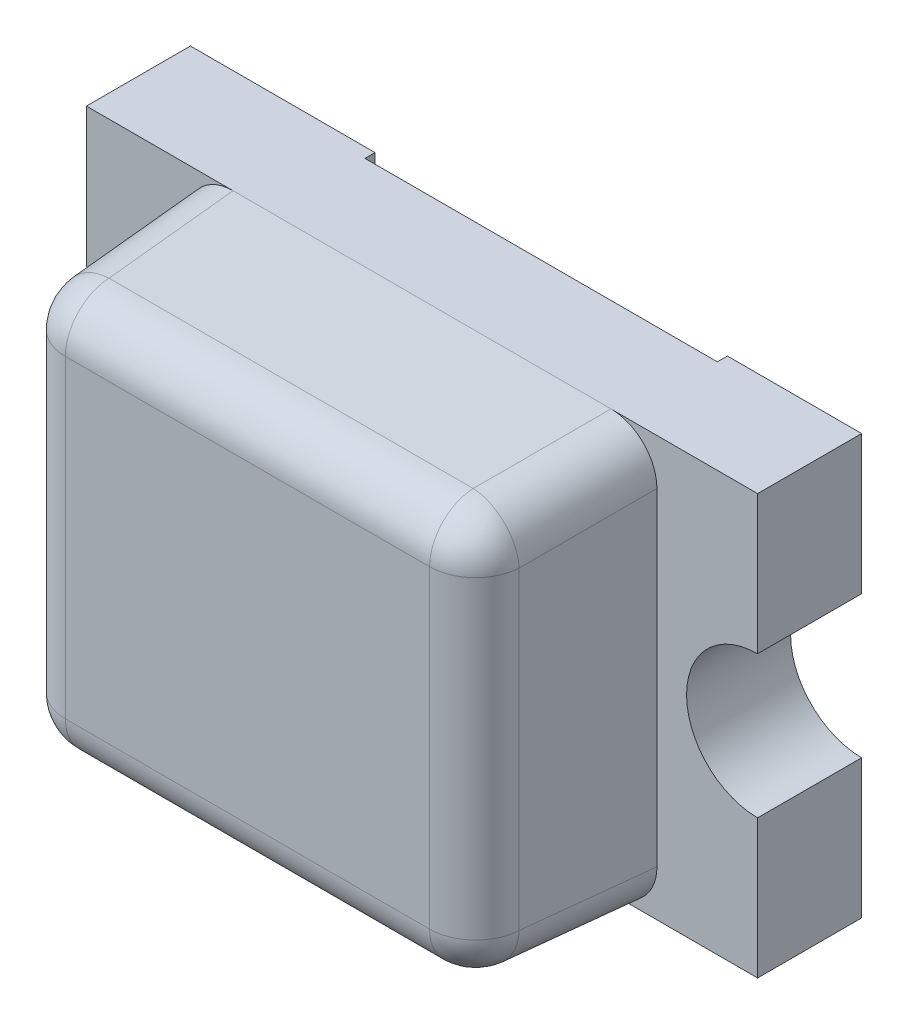
ISO-10303-21;
HEADER;
FILE_DESCRIPTION(('STEP AP214'),'2;1');
FILE_NAME('part.step','',(''),(''),'','','');
FILE_SCHEMA(('AUTOMOTIVE_DESIGN { 1 0 10303 214 1 1 1 1 }'));
ENDSEC;
DATA;
#1=APPLICATION_CONTEXT('core data for automotive mechanical design processes');
#2=APPLICATION_PROTOCOL_DEFINITION('international standard','automotive_design',2000,#1);
#3=PRODUCT_CONTEXT('',#1,'mechanical');
#4=PRODUCT('Part','Part','',(#3));
#5=PRODUCT_RELATED_PRODUCT_CATEGORY('part','',(#4));
#6=PRODUCT_DEFINITION_FORMATION('','',#4);
#7=PRODUCT_DEFINITION_CONTEXT('part definition',#1,'design');
#8=PRODUCT_DEFINITION('design','',#6,#7);
#9=PRODUCT_DEFINITION_SHAPE('','',#8);
#10=(LENGTH_UNIT() NAMED_UNIT(*) SI_UNIT(.MILLI.,.METRE.));
#11=(NAMED_UNIT(*) PLANE_ANGLE_UNIT() SI_UNIT($,.RADIAN.));
#12=(NAMED_UNIT(*) SI_UNIT($,.STERADIAN.) SOLID_ANGLE_UNIT());
#13=UNCERTAINTY_MEASURE_WITH_UNIT(LENGTH_MEASURE(1.E-05),#10,'distance_accuracy_value','');
#14=(GEOMETRIC_REPRESENTATION_CONTEXT(3) GLOBAL_UNCERTAINTY_ASSIGNED_CONTEXT((#13)) GLOBAL_UNIT_ASSIGNED_CONTEXT((#10,
#11,#12)) REPRESENTATION_CONTEXT('',''));
#15=CARTESIAN_POINT('',(0.,0.,0.));
#16=DIRECTION('',(0.,0.,1.));
#17=DIRECTION('',(1.,0.,0.));
#18=AXIS2_PLACEMENT_3D('',#15,#16,#17);
#19=CARTESIAN_POINT('',(0.163168531233106,-0.486831468766896,0.325652261310296));
#20=DIRECTION('',(-0.0522644276887139,-0.0522644276887139,-0.997264688634237));
#21=DIRECTION('',(0.,0.998629534754574,-0.0523359562429438));
#22=AXIS2_PLACEMENT_3D('',#19,#20,#21);
#23=CYLINDRICAL_SURFACE('',#22,0.13716);
#24=CARTESIAN_POINT('',(0.182412025197795,-0.467587974802207,0.69284));
#25=DIRECTION('',(0.052264427688714,0.052264427688714,0.997264688634237));
#26=DIRECTION('',(0.,-0.998629534754574,0.0523359562429439));
#27=AXIS2_PLACEMENT_3D('',#24,#25,#26);
#28=CIRCLE('',#27,0.13716);
#29=CARTESIAN_POINT('',(0.0454399982108576,-0.467587974802207,0.700018399758282));
#30=VERTEX_POINT('',#29);
#31=CARTESIAN_POINT('',(0.182412025197795,-0.604560001789144,0.700018399758282));
#32=VERTEX_POINT('',#31);
#33=EDGE_CURVE('E426',#30,#32,#28,.T.);
#34=ORIENTED_EDGE('',*,*,#33,.F.);
#35=DIRECTION('',(0.0522644276887139,0.0522644276887139,0.997264688634237));
#36=VECTOR('',#35,1.);
#37=CARTESIAN_POINT('',(0.02633308276625,-0.486694890246814,0.335436734478859));
#38=LINE('',#37,#36);
#39=CARTESIAN_POINT('',(0.0250000000000006,-0.488027973013064,0.31));
#40=VERTEX_POINT('',#39);
#41=EDGE_CURVE('E43',#40,#30,#38,.T.);
#42=ORIENTED_EDGE('',*,*,#41,.F.);
#43=CARTESIAN_POINT('',(0.162348230977076,-0.487651769022926,0.31));
#44=DIRECTION('',(0.,0.,1.));
#45=DIRECTION('',(-0.707106781186547,-0.707106781186548,0.));
#46=AXIS2_PLACEMENT_3D('',#43,#44,#45);
#47=ELLIPSE('',#46,0.137536204342943,0.13716);
#48=CARTESIAN_POINT('',(0.161972026986938,-0.625,0.31));
#49=VERTEX_POINT('',#48);
#50=EDGE_CURVE('E11',#40,#49,#47,.T.);
#51=ORIENTED_EDGE('',*,*,#50,.T.);
#52=DIRECTION('',(0.0522644276887139,0.0522644276887139,0.997264688634237));
#53=VECTOR('',#52,1.);
#54=CARTESIAN_POINT('',(0.163168531233106,-0.623803495753833,0.332830661068578));
#55=LINE('',#54,#53);
#56=EDGE_CURVE('E29',#49,#32,#55,.T.);
#57=ORIENTED_EDGE('',*,*,#56,.T.);
#58=EDGE_LOOP('',(#34,#42,#51,#57));
#59=FACE_BOUND('',#58,.T.);
#60=ADVANCED_FACE('F18',(#59),#23,.T.);
#61=CARTESIAN_POINT('',(0.182412025197795,-0.467587974802207,0.69284));
#62=DIRECTION('',(0.,0.,1.));
#63=DIRECTION('',(1.,0.,0.));
#64=AXIS2_PLACEMENT_3D('',#61,#62,#63);
#65=SPHERICAL_SURFACE('',#64,0.13716);
#66=CARTESIAN_POINT('',(0.182412025197795,-0.467587974802207,0.69284));
#67=DIRECTION('',(-1.,0.,0.));
#68=DIRECTION('',(0.,0.,1.));
#69=AXIS2_PLACEMENT_3D('',#66,#67,#68);
#70=CIRCLE('',#69,0.13716);
#71=CARTESIAN_POINT('',(0.182412025197795,-0.467587974802207,0.83));
#72=VERTEX_POINT('',#71);
#73=EDGE_CURVE('E310',#32,#72,#70,.T.);
#74=ORIENTED_EDGE('',*,*,#73,.T.);
#75=CARTESIAN_POINT('',(0.182412025197795,-0.467587974802207,0.69284));
#76=DIRECTION('',(0.,-1.,0.));
#77=DIRECTION('',(0.,0.,-1.));
#78=AXIS2_PLACEMENT_3D('',#75,#76,#77);
#79=CIRCLE('',#78,0.13716);
#80=EDGE_CURVE('E314',#72,#30,#79,.T.);
#81=ORIENTED_EDGE('',*,*,#80,.T.);
#82=ORIENTED_EDGE('',*,*,#33,.T.);
#83=EDGE_LOOP('',(#74,#81,#82));
#84=FACE_BOUND('',#83,.T.);
#85=ADVANCED_FACE('F540',(#84),#65,.T.);
#86=CARTESIAN_POINT('',(0.,-0.467587974802207,0.69284));
#87=DIRECTION('',(1.,0.,0.));
#88=DIRECTION('',(0.,1.,0.));
#89=AXIS2_PLACEMENT_3D('',#86,#87,#88);
#90=CYLINDRICAL_SURFACE('',#89,0.13716);
#91=CARTESIAN_POINT('',(1.26758797480221,-0.467587974802207,0.69284));
#92=DIRECTION('',(1.,0.,0.));
#93=DIRECTION('',(0.,0.,-1.));
#94=AXIS2_PLACEMENT_3D('',#91,#92,#93);
#95=CIRCLE('',#94,0.13716);
#96=CARTESIAN_POINT('',(1.26758797480221,-0.467587974802207,0.83));
#97=VERTEX_POINT('',#96);
#98=CARTESIAN_POINT('',(1.26758797480221,-0.604560001789144,0.700018399758282));
#99=VERTEX_POINT('',#98);
#100=EDGE_CURVE('E328',#97,#99,#95,.T.);
#101=ORIENTED_EDGE('',*,*,#100,.F.);
#102=DIRECTION('',(-1.,0.,0.));
#103=VECTOR('',#102,1.);
#104=CARTESIAN_POINT('',(1.39774795477282,-0.467587974802207,0.83));
#105=LINE('',#104,#103);
#106=EDGE_CURVE('E429',#97,#72,#105,.T.);
#107=ORIENTED_EDGE('',*,*,#106,.T.);
#108=ORIENTED_EDGE('',*,*,#73,.F.);
#109=DIRECTION('',(1.,0.,0.));
#110=VECTOR('',#109,1.);
#111=CARTESIAN_POINT('',(0.0522520452271821,-0.604560001789144,0.700018399758282));
#112=LINE('',#111,#110);
#113=EDGE_CURVE('E455',#32,#99,#112,.T.);
#114=ORIENTED_EDGE('',*,*,#113,.T.);
#115=EDGE_LOOP('',(#101,#107,#108,#114));
#116=FACE_BOUND('',#115,.T.);
#117=ADVANCED_FACE('F666',(#116),#90,.T.);
#118=CARTESIAN_POINT('',(0.182412025197795,0.,0.69284));
#119=DIRECTION('',(0.,-1.,0.));
#120=DIRECTION('',(1.,0.,0.));
#121=AXIS2_PLACEMENT_3D('',#118,#119,#120);
#122=CYLINDRICAL_SURFACE('',#121,0.13716);
#123=CARTESIAN_POINT('',(0.182412025197795,0.467587974802206,0.69284));
#124=DIRECTION('',(0.,1.,0.));
#125=DIRECTION('',(0.,0.,1.));
#126=AXIS2_PLACEMENT_3D('',#123,#124,#125);
#127=CIRCLE('',#126,0.13716);
#128=CARTESIAN_POINT('',(0.0454399982108576,0.467587974802206,0.700018399758282));
#129=VERTEX_POINT('',#128);
#130=CARTESIAN_POINT('',(0.182412025197795,0.467587974802206,0.83));
#131=VERTEX_POINT('',#130);
#132=EDGE_CURVE('E294',#129,#131,#127,.T.);
#133=ORIENTED_EDGE('',*,*,#132,.F.);
#134=DIRECTION('',(0.,-1.,0.));
#135=VECTOR('',#134,1.);
#136=CARTESIAN_POINT('',(0.0454399982108575,0.597747954772819,0.700018399758282));
#137=LINE('',#136,#135);
#138=EDGE_CURVE('E391',#129,#30,#137,.T.);
#139=ORIENTED_EDGE('',*,*,#138,.T.);
#140=ORIENTED_EDGE('',*,*,#80,.F.);
#141=DIRECTION('',(0.,1.,0.));
#142=VECTOR('',#141,1.);
#143=CARTESIAN_POINT('',(0.182412025197795,-0.597747954772819,0.83));
#144=LINE('',#143,#142);
#145=EDGE_CURVE('E387',#72,#131,#144,.T.);
#146=ORIENTED_EDGE('',*,*,#145,.T.);
#147=EDGE_LOOP('',(#133,#139,#140,#146));
#148=FACE_BOUND('',#147,.T.);
#149=ADVANCED_FACE('F544',(#148),#122,.T.);
#150=CARTESIAN_POINT('',(1.26758797480221,-0.467587974802207,0.69284));
#151=DIRECTION('',(0.,0.,1.));
#152=DIRECTION('',(1.,0.,0.));
#153=AXIS2_PLACEMENT_3D('',#150,#151,#152);
#154=SPHERICAL_SURFACE('',#153,0.13716);
#155=CARTESIAN_POINT('',(1.26758797480221,-0.467587974802206,0.69284));
#156=DIRECTION('',(-0.052264427688714,0.052264427688714,0.997264688634237));
#157=DIRECTION('',(0.,-0.998629534754574,0.0523359562429439));
#158=AXIS2_PLACEMENT_3D('',#155,#156,#157);
#159=CIRCLE('',#158,0.13716);
#160=CARTESIAN_POINT('',(1.40456000178914,-0.467587974802207,0.700018399758282));
#161=VERTEX_POINT('',#160);
#162=EDGE_CURVE('E338',#99,#161,#159,.T.);
#163=ORIENTED_EDGE('',*,*,#162,.T.);
#164=CARTESIAN_POINT('',(1.26758797480221,-0.467587974802207,0.69284));
#165=DIRECTION('',(0.,-1.,0.));
#166=DIRECTION('',(0.,0.,-1.));
#167=AXIS2_PLACEMENT_3D('',#164,#165,#166);
#168=CIRCLE('',#167,0.13716);
#169=EDGE_CURVE('E334',#161,#97,#168,.T.);
#170=ORIENTED_EDGE('',*,*,#169,.T.);
#171=ORIENTED_EDGE('',*,*,#100,.T.);
#172=EDGE_LOOP('',(#163,#170,#171));
#173=FACE_BOUND('',#172,.T.);
#174=ADVANCED_FACE('F702',(#173),#154,.T.);
#175=CARTESIAN_POINT('',(0.182412025197795,0.467587974802206,0.69284));
#176=DIRECTION('',(0.,0.,1.));
#177=DIRECTION('',(1.,0.,0.));
#178=AXIS2_PLACEMENT_3D('',#175,#176,#177);
#179=SPHERICAL_SURFACE('',#178,0.13716);
#180=CARTESIAN_POINT('',(0.182412025197795,0.467587974802206,0.69284));
#181=DIRECTION('',(-1.,0.,0.));
#182=DIRECTION('',(0.,-1.,0.));
#183=AXIS2_PLACEMENT_3D('',#180,#181,#182);
#184=CIRCLE('',#183,0.13716);
#185=CARTESIAN_POINT('',(0.182412025197795,0.604560001789144,0.700018399758282));
#186=VERTEX_POINT('',#185);
#187=EDGE_CURVE('E305',#131,#186,#184,.T.);
#188=ORIENTED_EDGE('',*,*,#187,.T.);
#189=CARTESIAN_POINT('',(0.182412025197795,0.467587974802206,0.69284));
#190=DIRECTION('',(0.052264427688714,-0.052264427688714,0.997264688634237));
#191=DIRECTION('',(0.998629534754574,0.,-0.0523359562429439));
#192=AXIS2_PLACEMENT_3D('',#189,#190,#191);
#193=CIRCLE('',#192,0.13716);
#194=EDGE_CURVE('E296',#186,#129,#193,.T.);
#195=ORIENTED_EDGE('',*,*,#194,.T.);
#196=ORIENTED_EDGE('',*,*,#132,.T.);
#197=EDGE_LOOP('',(#188,#195,#196));
#198=FACE_BOUND('',#197,.T.);
#199=ADVANCED_FACE('F699',(#198),#179,.T.);
#200=CARTESIAN_POINT('',(1.28669489024681,-0.486694890246814,0.328258334720577));
#201=DIRECTION('',(0.0522644276887139,-0.0522644276887139,-0.997264688634237));
#202=DIRECTION('',(-0.998629534754574,0.,-0.0523359562429438));
#203=AXIS2_PLACEMENT_3D('',#200,#201,#202);
#204=CYLINDRICAL_SURFACE('',#203,0.13716);
#205=CARTESIAN_POINT('',(1.28765176902293,-0.487651769022926,0.31));
#206=DIRECTION('',(0.,0.,1.));
#207=DIRECTION('',(0.707106781186548,-0.707106781186547,0.));
#208=AXIS2_PLACEMENT_3D('',#205,#206,#207);
#209=ELLIPSE('',#208,0.137536204342943,0.13716);
#210=CARTESIAN_POINT('',(1.28802797301306,-0.625,0.31));
#211=VERTEX_POINT('',#210);
#212=CARTESIAN_POINT('',(1.425,-0.488027973013063,0.31));
#213=VERTEX_POINT('',#212);
#214=EDGE_CURVE('E297',#211,#213,#209,.T.);
#215=ORIENTED_EDGE('',*,*,#214,.T.);
#216=DIRECTION('',(-0.0522644276887139,0.0522644276887139,0.997264688634237));
#217=VECTOR('',#216,1.);
#218=CARTESIAN_POINT('',(1.42366691723375,-0.486694890246814,0.335436734478859));
#219=LINE('',#218,#217);
#220=EDGE_CURVE('E83',#213,#161,#219,.T.);
#221=ORIENTED_EDGE('',*,*,#220,.T.);
#222=ORIENTED_EDGE('',*,*,#162,.F.);
#223=DIRECTION('',(-0.0522644276887139,0.0522644276887139,0.997264688634237));
#224=VECTOR('',#223,1.);
#225=CARTESIAN_POINT('',(1.28614857616649,-0.623120603153426,0.345861028119986));
#226=LINE('',#225,#224);
#227=EDGE_CURVE('E438',#211,#99,#226,.T.);
#228=ORIENTED_EDGE('',*,*,#227,.F.);
#229=EDGE_LOOP('',(#215,#221,#222,#228));
#230=FACE_BOUND('',#229,.T.);
#231=ADVANCED_FACE('F695',(#230),#204,.T.);
#232=CARTESIAN_POINT('',(1.26758797480221,0.,0.69284));
#233=DIRECTION('',(0.,1.,0.));
#234=DIRECTION('',(-1.,0.,0.));
#235=AXIS2_PLACEMENT_3D('',#232,#233,#234);
#236=CYLINDRICAL_SURFACE('',#235,0.13716);
#237=CARTESIAN_POINT('',(1.26758797480221,0.467587974802206,0.69284));
#238=DIRECTION('',(0.,1.,0.));
#239=DIRECTION('',(0.,0.,1.));
#240=AXIS2_PLACEMENT_3D('',#237,#238,#239);
#241=CIRCLE('',#240,0.13716);
#242=CARTESIAN_POINT('',(1.26758797480221,0.467587974802206,0.83));
#243=VERTEX_POINT('',#242);
#244=CARTESIAN_POINT('',(1.40456000178914,0.467587974802206,0.700018399758282));
#245=VERTEX_POINT('',#244);
#246=EDGE_CURVE('E400',#243,#245,#241,.T.);
#247=ORIENTED_EDGE('',*,*,#246,.F.);
#248=DIRECTION('',(0.,-1.,0.));
#249=VECTOR('',#248,1.);
#250=CARTESIAN_POINT('',(1.26758797480221,0.597747954772819,0.83));
#251=LINE('',#250,#249);
#252=EDGE_CURVE('E333',#243,#97,#251,.T.);
#253=ORIENTED_EDGE('',*,*,#252,.T.);
#254=ORIENTED_EDGE('',*,*,#169,.F.);
#255=DIRECTION('',(0.,1.,0.));
#256=VECTOR('',#255,1.);
#257=CARTESIAN_POINT('',(1.40456000178914,-0.597747954772819,0.700018399758282));
#258=LINE('',#257,#256);
#259=EDGE_CURVE('E329',#161,#245,#258,.T.);
#260=ORIENTED_EDGE('',*,*,#259,.T.);
#261=EDGE_LOOP('',(#247,#253,#254,#260));
#262=FACE_BOUND('',#261,.T.);
#263=ADVANCED_FACE('F692',(#262),#236,.T.);
#264=CARTESIAN_POINT('',(0.,0.467587974802206,0.69284));
#265=DIRECTION('',(-1.,0.,0.));
#266=DIRECTION('',(0.,0.,1.));
#267=AXIS2_PLACEMENT_3D('',#264,#265,#266);
#268=CYLINDRICAL_SURFACE('',#267,0.13716);
#269=CARTESIAN_POINT('',(1.26758797480221,0.467587974802206,0.69284));
#270=DIRECTION('',(1.,0.,0.));
#271=DIRECTION('',(0.,0.,-1.));
#272=AXIS2_PLACEMENT_3D('',#269,#270,#271);
#273=CIRCLE('',#272,0.13716);
#274=CARTESIAN_POINT('',(1.26758797480221,0.604560001789144,0.700018399758282));
#275=VERTEX_POINT('',#274);
#276=EDGE_CURVE('E292',#275,#243,#273,.T.);
#277=ORIENTED_EDGE('',*,*,#276,.F.);
#278=DIRECTION('',(-1.,0.,0.));
#279=VECTOR('',#278,1.);
#280=CARTESIAN_POINT('',(1.39774795477282,0.604560001789144,0.700018399758282));
#281=LINE('',#280,#279);
#282=EDGE_CURVE('E100',#275,#186,#281,.T.);
#283=ORIENTED_EDGE('',*,*,#282,.T.);
#284=ORIENTED_EDGE('',*,*,#187,.F.);
#285=DIRECTION('',(1.,0.,0.));
#286=VECTOR('',#285,1.);
#287=CARTESIAN_POINT('',(0.052252045227182,0.467587974802206,0.83));
#288=LINE('',#287,#286);
#289=EDGE_CURVE('E454',#131,#243,#288,.T.);
#290=ORIENTED_EDGE('',*,*,#289,.T.);
#291=EDGE_LOOP('',(#277,#283,#284,#290));
#292=FACE_BOUND('',#291,.T.);
#293=ADVANCED_FACE('F687',(#292),#268,.T.);
#294=CARTESIAN_POINT('',(0.163305109753187,0.486694890246814,0.328258334720577));
#295=DIRECTION('',(-0.0522644276887139,0.0522644276887139,-0.997264688634237));
#296=DIRECTION('',(-0.998629534754574,0.,0.0523359562429438));
#297=AXIS2_PLACEMENT_3D('',#294,#295,#296);
#298=CYLINDRICAL_SURFACE('',#297,0.13716);
#299=CARTESIAN_POINT('',(0.162348230977075,0.487651769022926,0.31));
#300=DIRECTION('',(0.,0.,1.));
#301=DIRECTION('',(-0.707106781186548,0.707106781186548,0.));
#302=AXIS2_PLACEMENT_3D('',#299,#300,#301);
#303=ELLIPSE('',#302,0.137536204342943,0.13716);
#304=CARTESIAN_POINT('',(0.161972026986938,0.625,0.31));
#305=VERTEX_POINT('',#304);
#306=CARTESIAN_POINT('',(0.0250000000000006,0.488027973013063,0.31));
#307=VERTEX_POINT('',#306);
#308=EDGE_CURVE('E399',#305,#307,#303,.T.);
#309=ORIENTED_EDGE('',*,*,#308,.T.);
#310=DIRECTION('',(0.0522644276887139,-0.0522644276887139,0.997264688634237));
#311=VECTOR('',#310,1.);
#312=CARTESIAN_POINT('',(0.02633308276625,0.486694890246814,0.335436734478859));
#313=LINE('',#312,#311);
#314=EDGE_CURVE('E395',#307,#129,#313,.T.);
#315=ORIENTED_EDGE('',*,*,#314,.T.);
#316=ORIENTED_EDGE('',*,*,#194,.F.);
#317=DIRECTION('',(0.0522644276887139,-0.0522644276887139,0.997264688634237));
#318=VECTOR('',#317,1.);
#319=CARTESIAN_POINT('',(0.163168531233106,0.623803495753833,0.332830661068578));
#320=LINE('',#319,#318);
#321=EDGE_CURVE('E350',#305,#186,#320,.T.);
#322=ORIENTED_EDGE('',*,*,#321,.F.);
#323=EDGE_LOOP('',(#309,#315,#316,#322));
#324=FACE_BOUND('',#323,.T.);
#325=ADVANCED_FACE('F683',(#324),#298,.T.);
#326=CARTESIAN_POINT('',(1.26758797480221,0.467587974802206,0.69284));
#327=DIRECTION('',(0.,0.,1.));
#328=DIRECTION('',(1.,0.,0.));
#329=AXIS2_PLACEMENT_3D('',#326,#327,#328);
#330=SPHERICAL_SURFACE('',#329,0.13716);
#331=ORIENTED_EDGE('',*,*,#246,.T.);
#332=CARTESIAN_POINT('',(1.26758797480221,0.467587974802206,0.69284));
#333=DIRECTION('',(-0.052264427688714,-0.0522644276887141,0.997264688634237));
#334=DIRECTION('',(0.,-0.998629534754574,-0.052335956242944));
#335=AXIS2_PLACEMENT_3D('',#332,#333,#334);
#336=CIRCLE('',#335,0.13716);
#337=EDGE_CURVE('E504',#245,#275,#336,.T.);
#338=ORIENTED_EDGE('',*,*,#337,.T.);
#339=ORIENTED_EDGE('',*,*,#276,.T.);
#340=EDGE_LOOP('',(#331,#338,#339));
#341=FACE_BOUND('',#340,.T.);
#342=ADVANCED_FACE('F686',(#341),#330,.T.);
#343=CARTESIAN_POINT('',(1.28614857616649,0.486148576166488,0.338682628361704));
#344=DIRECTION('',(0.0522644276887139,0.0522644276887139,-0.997264688634237));
#345=DIRECTION('',(0.,0.998629534754574,0.0523359562429438));
#346=AXIS2_PLACEMENT_3D('',#343,#344,#345);
#347=CYLINDRICAL_SURFACE('',#346,0.13716);
#348=ORIENTED_EDGE('',*,*,#337,.F.);
#349=DIRECTION('',(-0.0522644276887139,-0.0522644276887139,0.997264688634237));
#350=VECTOR('',#349,1.);
#351=CARTESIAN_POINT('',(1.42366691723375,0.486694890246814,0.335436734478859));
#352=LINE('',#351,#350);
#353=CARTESIAN_POINT('',(1.425,0.488027973013063,0.31));
#354=VERTEX_POINT('',#353);
#355=EDGE_CURVE('E434',#354,#245,#352,.T.);
#356=ORIENTED_EDGE('',*,*,#355,.F.);
#357=CARTESIAN_POINT('',(1.28765176902293,0.487651769022926,0.31));
#358=DIRECTION('',(0.,0.,1.));
#359=DIRECTION('',(0.707106781186548,0.707106781186548,0.));
#360=AXIS2_PLACEMENT_3D('',#357,#358,#359);
#361=ELLIPSE('',#360,0.137536204342943,0.13716);
#362=CARTESIAN_POINT('',(1.28802797301306,0.625,0.31));
#363=VERTEX_POINT('',#362);
#364=EDGE_CURVE('E349',#354,#363,#361,.T.);
#365=ORIENTED_EDGE('',*,*,#364,.T.);
#366=DIRECTION('',(-0.0522644276887139,-0.0522644276887139,0.997264688634237));
#367=VECTOR('',#366,1.);
#368=CARTESIAN_POINT('',(1.28614857616649,0.623120603153425,0.345861028119986));
#369=LINE('',#368,#367);
#370=EDGE_CURVE('E345',#363,#275,#369,.T.);
#371=ORIENTED_EDGE('',*,*,#370,.T.);
#372=EDGE_LOOP('',(#348,#356,#365,#371));
#373=FACE_BOUND('',#372,.T.);
#374=ADVANCED_FACE('F946',(#373),#347,.T.);
#375=CARTESIAN_POINT('',(0.,0.,0.83));
#376=DIRECTION('',(0.,0.,1.));
#377=DIRECTION('',(1.,0.,0.));
#378=AXIS2_PLACEMENT_3D('',#375,#376,#377);
#379=PLANE('',#378);
#380=ORIENTED_EDGE('',*,*,#145,.F.);
#381=ORIENTED_EDGE('',*,*,#106,.F.);
#382=ORIENTED_EDGE('',*,*,#252,.F.);
#383=ORIENTED_EDGE('',*,*,#289,.F.);
#384=EDGE_LOOP('',(#380,#381,#382,#383));
#385=FACE_BOUND('',#384,.T.);
#386=ADVANCED_FACE('F936',(#385),#379,.T.);
#387=CARTESIAN_POINT('',(0.6,0.625,0.31));
#388=DIRECTION('',(0.,0.998629534754574,0.0523359562429438));
#389=DIRECTION('',(1.,0.,0.));
#390=AXIS2_PLACEMENT_3D('',#387,#388,#389);
#391=PLANE('',#390);
#392=DIRECTION('',(1.,0.,0.));
#393=VECTOR('',#392,1.);
#394=CARTESIAN_POINT('',(0.6,0.625,0.31));
#395=LINE('',#394,#393);
#396=EDGE_CURVE('E419',#305,#363,#395,.T.);
#397=ORIENTED_EDGE('',*,*,#396,.F.);
#398=ORIENTED_EDGE('',*,*,#321,.T.);
#399=ORIENTED_EDGE('',*,*,#282,.F.);
#400=ORIENTED_EDGE('',*,*,#370,.F.);
#401=EDGE_LOOP('',(#397,#398,#399,#400));
#402=FACE_BOUND('',#401,.T.);
#403=ADVANCED_FACE('F927',(#402),#391,.T.);
#404=CARTESIAN_POINT('',(1.425,0.,0.31));
#405=DIRECTION('',(0.998629534754574,0.,0.0523359562429438));
#406=DIRECTION('',(0.,-1.,0.));
#407=AXIS2_PLACEMENT_3D('',#404,#405,#406);
#408=PLANE('',#407);
#409=ORIENTED_EDGE('',*,*,#259,.F.);
#410=ORIENTED_EDGE('',*,*,#220,.F.);
#411=DIRECTION('',(0.,-1.,0.));
#412=VECTOR('',#411,1.);
#413=CARTESIAN_POINT('',(1.425,0.,0.31));
#414=LINE('',#413,#412);
#415=EDGE_CURVE('E301',#354,#213,#414,.T.);
#416=ORIENTED_EDGE('',*,*,#415,.F.);
#417=ORIENTED_EDGE('',*,*,#355,.T.);
#418=EDGE_LOOP('',(#409,#410,#416,#417));
#419=FACE_BOUND('',#418,.T.);
#420=ADVANCED_FACE('F20',(#419),#408,.T.);
#421=CARTESIAN_POINT('',(0.6,-0.625,0.31));
#422=DIRECTION('',(0.,-0.998629534754574,0.0523359562429438));
#423=DIRECTION('',(-1.,0.,0.));
#424=AXIS2_PLACEMENT_3D('',#421,#422,#423);
#425=PLANE('',#424);
#426=ORIENTED_EDGE('',*,*,#113,.F.);
#427=ORIENTED_EDGE('',*,*,#56,.F.);
#428=DIRECTION('',(-1.,0.,0.));
#429=VECTOR('',#428,1.);
#430=CARTESIAN_POINT('',(0.6,-0.625,0.31));
#431=LINE('',#430,#429);
#432=EDGE_CURVE('E383',#211,#49,#431,.T.);
#433=ORIENTED_EDGE('',*,*,#432,.F.);
#434=ORIENTED_EDGE('',*,*,#227,.T.);
#435=EDGE_LOOP('',(#426,#427,#433,#434));
#436=FACE_BOUND('',#435,.T.);
#437=ADVANCED_FACE('F642',(#436),#425,.T.);
#438=CARTESIAN_POINT('',(0.0250000000000006,0.,0.31));
#439=DIRECTION('',(-0.998629534754574,0.,0.0523359562429438));
#440=DIRECTION('',(0.,1.,0.));
#441=AXIS2_PLACEMENT_3D('',#438,#439,#440);
#442=PLANE('',#441);
#443=DIRECTION('',(0.,1.,0.));
#444=VECTOR('',#443,1.);
#445=CARTESIAN_POINT('',(0.0250000000000006,0.,0.31));
#446=LINE('',#445,#444);
#447=EDGE_CURVE('E372',#40,#307,#446,.T.);
#448=ORIENTED_EDGE('',*,*,#447,.F.);
#449=ORIENTED_EDGE('',*,*,#41,.T.);
#450=ORIENTED_EDGE('',*,*,#138,.F.);
#451=ORIENTED_EDGE('',*,*,#314,.F.);
#452=EDGE_LOOP('',(#448,#449,#450,#451));
#453=FACE_BOUND('',#452,.T.);
#454=ADVANCED_FACE('F676',(#453),#442,.T.);
#455=CARTESIAN_POINT('',(-0.275,0.,0.));
#456=DIRECTION('',(0.,0.,1.));
#457=DIRECTION('',(1.,0.,0.));
#458=AXIS2_PLACEMENT_3D('',#455,#456,#457);
#459=PLANE('',#458);
#460=DIRECTION('',(0.,1.,0.));
#461=VECTOR('',#460,1.);
#462=CARTESIAN_POINT('',(-0.275,0.211688070581402,0.));
#463=LINE('',#462,#461);
#464=CARTESIAN_POINT('',(-0.275,0.211688070581401,0.));
#465=VERTEX_POINT('',#464);
#466=CARTESIAN_POINT('',(-0.275,0.625,0.));
#467=VERTEX_POINT('',#466);
#468=EDGE_CURVE('E343',#465,#467,#463,.T.);
#469=ORIENTED_EDGE('',*,*,#468,.T.);
#470=DIRECTION('',(1.,0.,0.));
#471=VECTOR('',#470,1.);
#472=CARTESIAN_POINT('',(-0.275,0.625,0.));
#473=LINE('',#472,#471);
#474=CARTESIAN_POINT('',(0.275,0.625,0.));
#475=VERTEX_POINT('',#474);
#476=EDGE_CURVE('E339',#467,#475,#473,.T.);
#477=ORIENTED_EDGE('',*,*,#476,.T.);
#478=DIRECTION('',(0.,-1.,0.));
#479=VECTOR('',#478,1.);
#480=CARTESIAN_POINT('',(0.275,0.625,0.));
#481=LINE('',#480,#479);
#482=CARTESIAN_POINT('',(0.275,-0.625,0.));
#483=VERTEX_POINT('',#482);
#484=EDGE_CURVE('E344',#475,#483,#481,.T.);
#485=ORIENTED_EDGE('',*,*,#484,.T.);
#486=DIRECTION('',(-1.,0.,0.));
#487=VECTOR('',#486,1.);
#488=CARTESIAN_POINT('',(0.275,-0.625,0.));
#489=LINE('',#488,#487);
#490=CARTESIAN_POINT('',(-0.275,-0.625,0.));
#491=VERTEX_POINT('',#490);
#492=EDGE_CURVE('E433',#483,#491,#489,.T.);
#493=ORIENTED_EDGE('',*,*,#492,.T.);
#494=DIRECTION('',(0.,1.,0.));
#495=VECTOR('',#494,1.);
#496=CARTESIAN_POINT('',(-0.275,-0.625,0.));
#497=LINE('',#496,#495);
#498=CARTESIAN_POINT('',(-0.275,-0.211688070581402,0.));
#499=VERTEX_POINT('',#498);
#500=EDGE_CURVE('E404',#491,#499,#497,.T.);
#501=ORIENTED_EDGE('',*,*,#500,.T.);
#502=CARTESIAN_POINT('',(-0.275,0.,0.));
#503=DIRECTION('',(0.,0.,1.));
#504=DIRECTION('',(-1.,0.,0.));
#505=AXIS2_PLACEMENT_3D('',#502,#503,#504);
#506=CIRCLE('',#505,0.211688070581401);
#507=EDGE_CURVE('E401',#499,#465,#506,.T.);
#508=ORIENTED_EDGE('',*,*,#507,.T.);
#509=EDGE_LOOP('',(#469,#477,#485,#493,#501,#508));
#510=FACE_BOUND('',#509,.T.);
#511=ADVANCED_FACE('F588',(#510),#459,.F.);
#512=CARTESIAN_POINT('',(-0.275,0.,0.03));
#513=DIRECTION('',(0.,0.,-1.));
#514=DIRECTION('',(-1.,0.,0.));
#515=AXIS2_PLACEMENT_3D('',#512,#513,#514);
#516=CYLINDRICAL_SURFACE('',#515,0.211688070581401);
#517=ORIENTED_EDGE('',*,*,#507,.F.);
#518=DIRECTION('',(0.,0.,-1.));
#519=VECTOR('',#518,1.);
#520=CARTESIAN_POINT('',(-0.275,-0.211688070581402,0.03));
#521=LINE('',#520,#519);
#522=CARTESIAN_POINT('',(-0.275,-0.211688070581402,0.31));
#523=VERTEX_POINT('',#522);
#524=EDGE_CURVE('E317',#523,#499,#521,.T.);
#525=ORIENTED_EDGE('',*,*,#524,.F.);
#526=CARTESIAN_POINT('',(-0.275,0.,0.31));
#527=DIRECTION('',(0.,0.,1.));
#528=DIRECTION('',(-1.,0.,0.));
#529=AXIS2_PLACEMENT_3D('',#526,#527,#528);
#530=CIRCLE('',#529,0.211688070581401);
#531=CARTESIAN_POINT('',(-0.275,0.211688070581401,0.31));
#532=VERTEX_POINT('',#531);
#533=EDGE_CURVE('E405',#523,#532,#530,.T.);
#534=ORIENTED_EDGE('',*,*,#533,.T.);
#535=DIRECTION('',(0.,0.,-1.));
#536=VECTOR('',#535,1.);
#537=CARTESIAN_POINT('',(-0.275,0.211688070581401,0.03));
#538=LINE('',#537,#536);
#539=EDGE_CURVE('E568',#532,#465,#538,.T.);
#540=ORIENTED_EDGE('',*,*,#539,.T.);
#541=EDGE_LOOP('',(#517,#525,#534,#540));
#542=FACE_BOUND('',#541,.T.);
#543=ADVANCED_FACE('F580',(#542),#516,.F.);
#544=CARTESIAN_POINT('',(-0.275,-0.625,0.03));
#545=DIRECTION('',(-1.,0.,0.));
#546=DIRECTION('',(0.,0.,1.));
#547=AXIS2_PLACEMENT_3D('',#544,#545,#546);
#548=PLANE('',#547);
#549=ORIENTED_EDGE('',*,*,#500,.F.);
#550=DIRECTION('',(0.,0.,-1.));
#551=VECTOR('',#550,1.);
#552=CARTESIAN_POINT('',(-0.275,-0.625,0.03));
#553=LINE('',#552,#551);
#554=CARTESIAN_POINT('',(-0.275,-0.625,0.31));
#555=VERTEX_POINT('',#554);
#556=EDGE_CURVE('E217',#555,#491,#553,.T.);
#557=ORIENTED_EDGE('',*,*,#556,.F.);
#558=DIRECTION('',(0.,1.,0.));
#559=VECTOR('',#558,1.);
#560=CARTESIAN_POINT('',(-0.275,-0.211688070581402,0.31));
#561=LINE('',#560,#559);
#562=EDGE_CURVE('E444',#555,#523,#561,.T.);
#563=ORIENTED_EDGE('',*,*,#562,.T.);
#564=ORIENTED_EDGE('',*,*,#524,.T.);
#565=EDGE_LOOP('',(#549,#557,#563,#564));
#566=FACE_BOUND('',#565,.T.);
#567=ADVANCED_FACE('F647',(#566),#548,.T.);
#568=CARTESIAN_POINT('',(0.275,-0.625,0.03));
#569=DIRECTION('',(0.,-1.,0.));
#570=DIRECTION('',(0.,0.,-1.));
#571=AXIS2_PLACEMENT_3D('',#568,#569,#570);
#572=PLANE('',#571);
#573=ORIENTED_EDGE('',*,*,#492,.F.);
#574=DIRECTION('',(0.,0.,-1.));
#575=VECTOR('',#574,1.);
#576=CARTESIAN_POINT('',(0.275,-0.625,0.03));
#577=LINE('',#576,#575);
#578=CARTESIAN_POINT('',(0.275,-0.625,0.03));
#579=VERTEX_POINT('',#578);
#580=EDGE_CURVE('E358',#579,#483,#577,.T.);
#581=ORIENTED_EDGE('',*,*,#580,.F.);
#582=DIRECTION('',(-1.,0.,0.));
#583=VECTOR('',#582,1.);
#584=CARTESIAN_POINT('',(1.725,-0.625,0.03));
#585=LINE('',#584,#583);
#586=CARTESIAN_POINT('',(1.325,-0.625,0.03));
#587=VERTEX_POINT('',#586);
#588=EDGE_CURVE('E229',#587,#579,#585,.T.);
#589=ORIENTED_EDGE('',*,*,#588,.F.);
#590=DIRECTION('',(0.,0.,-1.));
#591=VECTOR('',#590,1.);
#592=CARTESIAN_POINT('',(1.325,-0.625,0.03));
#593=LINE('',#592,#591);
#594=CARTESIAN_POINT('',(1.325,-0.625,0.));
#595=VERTEX_POINT('',#594);
#596=EDGE_CURVE('E273',#587,#595,#593,.T.);
#597=ORIENTED_EDGE('',*,*,#596,.T.);
#598=DIRECTION('',(-1.,0.,0.));
#599=VECTOR('',#598,1.);
#600=CARTESIAN_POINT('',(1.725,-0.625,0.));
#601=LINE('',#600,#599);
#602=CARTESIAN_POINT('',(1.725,-0.625,0.));
#603=VERTEX_POINT('',#602);
#604=EDGE_CURVE('E271',#603,#595,#601,.T.);
#605=ORIENTED_EDGE('',*,*,#604,.F.);
#606=DIRECTION('',(0.,0.,-1.));
#607=VECTOR('',#606,1.);
#608=CARTESIAN_POINT('',(1.725,-0.625,0.03));
#609=LINE('',#608,#607);
#610=CARTESIAN_POINT('',(1.725,-0.625,0.31));
#611=VERTEX_POINT('',#610);
#612=EDGE_CURVE('E257',#611,#603,#609,.T.);
#613=ORIENTED_EDGE('',*,*,#612,.F.);
#614=DIRECTION('',(-1.,0.,0.));
#615=VECTOR('',#614,1.);
#616=CARTESIAN_POINT('',(1.725,-0.625,0.31));
#617=LINE('',#616,#615);
#618=EDGE_CURVE('E318',#611,#211,#617,.T.);
#619=ORIENTED_EDGE('',*,*,#618,.T.);
#620=ORIENTED_EDGE('',*,*,#432,.T.);
#621=DIRECTION('',(-1.,0.,0.));
#622=VECTOR('',#621,1.);
#623=CARTESIAN_POINT('',(1.725,-0.625,0.31));
#624=LINE('',#623,#622);
#625=EDGE_CURVE('E416',#49,#555,#624,.T.);
#626=ORIENTED_EDGE('',*,*,#625,.T.);
#627=ORIENTED_EDGE('',*,*,#556,.T.);
#628=EDGE_LOOP('',(#573,#581,#589,#597,#605,#613,#619,#620,#626,#627));
#629=FACE_BOUND('',#628,.T.);
#630=ADVANCED_FACE('F272',(#629),#572,.T.);
#631=CARTESIAN_POINT('',(0.275,0.625,0.03));
#632=DIRECTION('',(1.,0.,0.));
#633=DIRECTION('',(0.,1.,0.));
#634=AXIS2_PLACEMENT_3D('',#631,#632,#633);
#635=PLANE('',#634);
#636=ORIENTED_EDGE('',*,*,#484,.F.);
#637=DIRECTION('',(0.,0.,-1.));
#638=VECTOR('',#637,1.);
#639=CARTESIAN_POINT('',(0.275,0.625,0.03));
#640=LINE('',#639,#638);
#641=CARTESIAN_POINT('',(0.275,0.625,0.03));
#642=VERTEX_POINT('',#641);
#643=EDGE_CURVE('E352',#642,#475,#640,.T.);
#644=ORIENTED_EDGE('',*,*,#643,.F.);
#645=DIRECTION('',(0.,-1.,0.));
#646=VECTOR('',#645,1.);
#647=CARTESIAN_POINT('',(0.275,0.625,0.03));
#648=LINE('',#647,#646);
#649=EDGE_CURVE('E354',#642,#579,#648,.T.);
#650=ORIENTED_EDGE('',*,*,#649,.T.);
#651=ORIENTED_EDGE('',*,*,#580,.T.);
#652=EDGE_LOOP('',(#636,#644,#650,#651));
#653=FACE_BOUND('',#652,.T.);
#654=ADVANCED_FACE('F649',(#653),#635,.T.);
#655=CARTESIAN_POINT('',(-0.275,0.625,0.03));
#656=DIRECTION('',(0.,1.,0.));
#657=DIRECTION('',(1.,0.,0.));
#658=AXIS2_PLACEMENT_3D('',#655,#656,#657);
#659=PLANE('',#658);
#660=ORIENTED_EDGE('',*,*,#476,.F.);
#661=DIRECTION('',(0.,0.,-1.));
#662=VECTOR('',#661,1.);
#663=CARTESIAN_POINT('',(-0.275,0.625,0.03));
#664=LINE('',#663,#662);
#665=CARTESIAN_POINT('',(-0.275,0.625,0.31));
#666=VERTEX_POINT('',#665);
#667=EDGE_CURVE('E362',#666,#467,#664,.T.);
#668=ORIENTED_EDGE('',*,*,#667,.F.);
#669=DIRECTION('',(1.,0.,0.));
#670=VECTOR('',#669,1.);
#671=CARTESIAN_POINT('',(-0.275,0.625,0.31));
#672=LINE('',#671,#670);
#673=EDGE_CURVE('E380',#666,#305,#672,.T.);
#674=ORIENTED_EDGE('',*,*,#673,.T.);
#675=ORIENTED_EDGE('',*,*,#396,.T.);
#676=DIRECTION('',(1.,0.,0.));
#677=VECTOR('',#676,1.);
#678=CARTESIAN_POINT('',(-0.275,0.625,0.31));
#679=LINE('',#678,#677);
#680=CARTESIAN_POINT('',(1.725,0.625,0.31));
#681=VERTEX_POINT('',#680);
#682=EDGE_CURVE('E22',#363,#681,#679,.T.);
#683=ORIENTED_EDGE('',*,*,#682,.T.);
#684=DIRECTION('',(0.,0.,-1.));
#685=VECTOR('',#684,1.);
#686=CARTESIAN_POINT('',(1.725,0.625,0.03));
#687=LINE('',#686,#685);
#688=CARTESIAN_POINT('',(1.725,0.625,0.));
#689=VERTEX_POINT('',#688);
#690=EDGE_CURVE('E174',#681,#689,#687,.T.);
#691=ORIENTED_EDGE('',*,*,#690,.T.);
#692=DIRECTION('',(1.,0.,0.));
#693=VECTOR('',#692,1.);
#694=CARTESIAN_POINT('',(1.325,0.625,0.));
#695=LINE('',#694,#693);
#696=CARTESIAN_POINT('',(1.325,0.625,0.));
#697=VERTEX_POINT('',#696);
#698=EDGE_CURVE('E164',#697,#689,#695,.T.);
#699=ORIENTED_EDGE('',*,*,#698,.F.);
#700=DIRECTION('',(0.,0.,-1.));
#701=VECTOR('',#700,1.);
#702=CARTESIAN_POINT('',(1.325,0.625,0.03));
#703=LINE('',#702,#701);
#704=CARTESIAN_POINT('',(1.325,0.625,0.03));
#705=VERTEX_POINT('',#704);
#706=EDGE_CURVE('E376',#705,#697,#703,.T.);
#707=ORIENTED_EDGE('',*,*,#706,.F.);
#708=DIRECTION('',(1.,0.,0.));
#709=VECTOR('',#708,1.);
#710=CARTESIAN_POINT('',(-0.275,0.625,0.03));
#711=LINE('',#710,#709);
#712=EDGE_CURVE('E300',#642,#705,#711,.T.);
#713=ORIENTED_EDGE('',*,*,#712,.F.);
#714=ORIENTED_EDGE('',*,*,#643,.T.);
#715=EDGE_LOOP('',(#660,#668,#674,#675,#683,#691,#699,#707,#713,#714));
#716=FACE_BOUND('',#715,.T.);
#717=ADVANCED_FACE('F626',(#716),#659,.T.);
#718=CARTESIAN_POINT('',(-0.275,0.211688070581402,0.03));
#719=DIRECTION('',(-1.,0.,0.));
#720=DIRECTION('',(0.,0.,1.));
#721=AXIS2_PLACEMENT_3D('',#718,#719,#720);
#722=PLANE('',#721);
#723=ORIENTED_EDGE('',*,*,#468,.F.);
#724=ORIENTED_EDGE('',*,*,#539,.F.);
#725=DIRECTION('',(0.,1.,0.));
#726=VECTOR('',#725,1.);
#727=CARTESIAN_POINT('',(-0.275,0.211688070581401,0.31));
#728=LINE('',#727,#726);
#729=EDGE_CURVE('E409',#532,#666,#728,.T.);
#730=ORIENTED_EDGE('',*,*,#729,.T.);
#731=ORIENTED_EDGE('',*,*,#667,.T.);
#732=EDGE_LOOP('',(#723,#724,#730,#731));
#733=FACE_BOUND('',#732,.T.);
#734=ADVANCED_FACE('F585',(#733),#722,.T.);
#735=CARTESIAN_POINT('',(1.725,0.,0.03));
#736=DIRECTION('',(0.,0.,1.));
#737=DIRECTION('',(1.,0.,0.));
#738=AXIS2_PLACEMENT_3D('',#735,#736,#737);
#739=PLANE('',#738);
#740=ORIENTED_EDGE('',*,*,#649,.F.);
#741=ORIENTED_EDGE('',*,*,#712,.T.);
#742=DIRECTION('',(0.,1.,0.));
#743=VECTOR('',#742,1.);
#744=CARTESIAN_POINT('',(1.325,0.2,0.03));
#745=LINE('',#744,#743);
#746=CARTESIAN_POINT('',(1.325,0.2,0.03));
#747=VERTEX_POINT('',#746);
#748=EDGE_CURVE('E408',#747,#705,#745,.T.);
#749=ORIENTED_EDGE('',*,*,#748,.F.);
#750=DIRECTION('',(1.,0.,0.));
#751=VECTOR('',#750,1.);
#752=CARTESIAN_POINT('',(1.325,0.2,0.03));
#753=LINE('',#752,#751);
#754=CARTESIAN_POINT('',(1.175,0.2,0.03));
#755=VERTEX_POINT('',#754);
#756=EDGE_CURVE('E363',#755,#747,#753,.T.);
#757=ORIENTED_EDGE('',*,*,#756,.F.);
#758=DIRECTION('',(0.,1.,0.));
#759=VECTOR('',#758,1.);
#760=CARTESIAN_POINT('',(1.175,0.2,0.03));
#761=LINE('',#760,#759);
#762=CARTESIAN_POINT('',(1.175,-0.2,0.03));
#763=VERTEX_POINT('',#762);
#764=EDGE_CURVE('E459',#763,#755,#761,.T.);
#765=ORIENTED_EDGE('',*,*,#764,.F.);
#766=DIRECTION('',(-1.,0.,0.));
#767=VECTOR('',#766,1.);
#768=CARTESIAN_POINT('',(1.175,-0.2,0.03));
#769=LINE('',#768,#767);
#770=CARTESIAN_POINT('',(1.325,-0.2,0.03));
#771=VERTEX_POINT('',#770);
#772=EDGE_CURVE('E323',#771,#763,#769,.T.);
#773=ORIENTED_EDGE('',*,*,#772,.F.);
#774=DIRECTION('',(0.,1.,0.));
#775=VECTOR('',#774,1.);
#776=CARTESIAN_POINT('',(1.325,-0.625,0.03));
#777=LINE('',#776,#775);
#778=EDGE_CURVE('E324',#587,#771,#777,.T.);
#779=ORIENTED_EDGE('',*,*,#778,.F.);
#780=ORIENTED_EDGE('',*,*,#588,.T.);
#781=EDGE_LOOP('',(#740,#741,#749,#757,#765,#773,#779,#780));
#782=FACE_BOUND('',#781,.T.);
#783=ADVANCED_FACE('F622',(#782),#739,.F.);
#784=CARTESIAN_POINT('',(1.725,0.,0.31));
#785=DIRECTION('',(0.,0.,1.));
#786=DIRECTION('',(1.,0.,0.));
#787=AXIS2_PLACEMENT_3D('',#784,#785,#786);
#788=PLANE('',#787);
#789=ORIENTED_EDGE('',*,*,#415,.T.);
#790=ORIENTED_EDGE('',*,*,#214,.F.);
#791=ORIENTED_EDGE('',*,*,#618,.F.);
#792=DIRECTION('',(0.,-1.,0.));
#793=VECTOR('',#792,1.);
#794=CARTESIAN_POINT('',(1.725,-0.211688070581401,0.31));
#795=LINE('',#794,#793);
#796=CARTESIAN_POINT('',(1.725,-0.211688070581401,0.31));
#797=VERTEX_POINT('',#796);
#798=EDGE_CURVE('E265',#797,#611,#795,.T.);
#799=ORIENTED_EDGE('',*,*,#798,.F.);
#800=CARTESIAN_POINT('',(1.725,0.,0.31));
#801=DIRECTION('',(0.,0.,1.));
#802=DIRECTION('',(1.,0.,0.));
#803=AXIS2_PLACEMENT_3D('',#800,#801,#802);
#804=CIRCLE('',#803,0.211688070581401);
#805=CARTESIAN_POINT('',(1.725,0.211688070581401,0.31));
#806=VERTEX_POINT('',#805);
#807=EDGE_CURVE('E269',#806,#797,#804,.T.);
#808=ORIENTED_EDGE('',*,*,#807,.F.);
#809=DIRECTION('',(0.,-1.,0.));
#810=VECTOR('',#809,1.);
#811=CARTESIAN_POINT('',(1.725,0.625,0.31));
#812=LINE('',#811,#810);
#813=EDGE_CURVE('E309',#681,#806,#812,.T.);
#814=ORIENTED_EDGE('',*,*,#813,.F.);
#815=ORIENTED_EDGE('',*,*,#682,.F.);
#816=ORIENTED_EDGE('',*,*,#364,.F.);
#817=EDGE_LOOP('',(#789,#790,#791,#799,#808,#814,#815,#816));
#818=FACE_BOUND('',#817,.T.);
#819=ADVANCED_FACE('F635',(#818),#788,.T.);
#820=CARTESIAN_POINT('',(1.725,0.,0.));
#821=DIRECTION('',(0.,0.,1.));
#822=DIRECTION('',(1.,0.,0.));
#823=AXIS2_PLACEMENT_3D('',#820,#821,#822);
#824=PLANE('',#823);
#825=DIRECTION('',(0.,1.,0.));
#826=VECTOR('',#825,1.);
#827=CARTESIAN_POINT('',(1.325,0.2,0.));
#828=LINE('',#827,#826);
#829=CARTESIAN_POINT('',(1.325,0.2,0.));
#830=VERTEX_POINT('',#829);
#831=EDGE_CURVE('E384',#830,#697,#828,.T.);
#832=ORIENTED_EDGE('',*,*,#831,.T.);
#833=ORIENTED_EDGE('',*,*,#698,.T.);
#834=DIRECTION('',(0.,-1.,0.));
#835=VECTOR('',#834,1.);
#836=CARTESIAN_POINT('',(1.725,0.625,0.));
#837=LINE('',#836,#835);
#838=CARTESIAN_POINT('',(1.725,0.211688070581402,0.));
#839=VERTEX_POINT('',#838);
#840=EDGE_CURVE('E288',#689,#839,#837,.T.);
#841=ORIENTED_EDGE('',*,*,#840,.T.);
#842=CARTESIAN_POINT('',(1.725,0.,0.));
#843=DIRECTION('',(0.,0.,1.));
#844=DIRECTION('',(1.,0.,0.));
#845=AXIS2_PLACEMENT_3D('',#842,#843,#844);
#846=CIRCLE('',#845,0.211688070581401);
#847=CARTESIAN_POINT('',(1.725,-0.211688070581401,0.));
#848=VERTEX_POINT('',#847);
#849=EDGE_CURVE('E280',#839,#848,#846,.T.);
#850=ORIENTED_EDGE('',*,*,#849,.T.);
#851=DIRECTION('',(0.,-1.,0.));
#852=VECTOR('',#851,1.);
#853=CARTESIAN_POINT('',(1.725,-0.211688070581402,0.));
#854=LINE('',#853,#852);
#855=EDGE_CURVE('E262',#848,#603,#854,.T.);
#856=ORIENTED_EDGE('',*,*,#855,.T.);
#857=ORIENTED_EDGE('',*,*,#604,.T.);
#858=DIRECTION('',(0.,1.,0.));
#859=VECTOR('',#858,1.);
#860=CARTESIAN_POINT('',(1.325,-0.625,0.));
#861=LINE('',#860,#859);
#862=CARTESIAN_POINT('',(1.325,-0.2,0.));
#863=VERTEX_POINT('',#862);
#864=EDGE_CURVE('E277',#595,#863,#861,.T.);
#865=ORIENTED_EDGE('',*,*,#864,.T.);
#866=DIRECTION('',(-1.,0.,0.));
#867=VECTOR('',#866,1.);
#868=CARTESIAN_POINT('',(1.175,-0.2,0.));
#869=LINE('',#868,#867);
#870=CARTESIAN_POINT('',(1.175,-0.2,0.));
#871=VERTEX_POINT('',#870);
#872=EDGE_CURVE('E450',#863,#871,#869,.T.);
#873=ORIENTED_EDGE('',*,*,#872,.T.);
#874=DIRECTION('',(0.,1.,0.));
#875=VECTOR('',#874,1.);
#876=CARTESIAN_POINT('',(1.175,0.2,0.));
#877=LINE('',#876,#875);
#878=CARTESIAN_POINT('',(1.175,0.2,0.));
#879=VERTEX_POINT('',#878);
#880=EDGE_CURVE('E446',#871,#879,#877,.T.);
#881=ORIENTED_EDGE('',*,*,#880,.T.);
#882=DIRECTION('',(1.,0.,0.));
#883=VECTOR('',#882,1.);
#884=CARTESIAN_POINT('',(1.325,0.2,0.));
#885=LINE('',#884,#883);
#886=EDGE_CURVE('E367',#879,#830,#885,.T.);
#887=ORIENTED_EDGE('',*,*,#886,.T.);
#888=EDGE_LOOP('',(#832,#833,#841,#850,#856,#857,#865,#873,#881,#887));
#889=FACE_BOUND('',#888,.T.);
#890=ADVANCED_FACE('F279',(#889),#824,.F.);
#891=CARTESIAN_POINT('',(1.325,0.2,0.03));
#892=DIRECTION('',(0.,1.,0.));
#893=DIRECTION('',(1.,0.,0.));
#894=AXIS2_PLACEMENT_3D('',#891,#892,#893);
#895=PLANE('',#894);
#896=ORIENTED_EDGE('',*,*,#886,.F.);
#897=DIRECTION('',(0.,0.,-1.));
#898=VECTOR('',#897,1.);
#899=CARTESIAN_POINT('',(1.175,0.2,0.03));
#900=LINE('',#899,#898);
#901=EDGE_CURVE('E462',#755,#879,#900,.T.);
#902=ORIENTED_EDGE('',*,*,#901,.F.);
#903=ORIENTED_EDGE('',*,*,#756,.T.);
#904=DIRECTION('',(0.,0.,-1.));
#905=VECTOR('',#904,1.);
#906=CARTESIAN_POINT('',(1.325,0.2,0.03));
#907=LINE('',#906,#905);
#908=EDGE_CURVE('E368',#747,#830,#907,.T.);
#909=ORIENTED_EDGE('',*,*,#908,.T.);
#910=EDGE_LOOP('',(#896,#902,#903,#909));
#911=FACE_BOUND('',#910,.T.);
#912=ADVANCED_FACE('F619',(#911),#895,.T.);
#913=CARTESIAN_POINT('',(1.175,0.2,0.03));
#914=DIRECTION('',(-1.,0.,0.));
#915=DIRECTION('',(0.,0.,1.));
#916=AXIS2_PLACEMENT_3D('',#913,#914,#915);
#917=PLANE('',#916);
#918=ORIENTED_EDGE('',*,*,#880,.F.);
#919=DIRECTION('',(0.,0.,-1.));
#920=VECTOR('',#919,1.);
#921=CARTESIAN_POINT('',(1.175,-0.2,0.03));
#922=LINE('',#921,#920);
#923=EDGE_CURVE('E319',#763,#871,#922,.T.);
#924=ORIENTED_EDGE('',*,*,#923,.F.);
#925=ORIENTED_EDGE('',*,*,#764,.T.);
#926=ORIENTED_EDGE('',*,*,#901,.T.);
#927=EDGE_LOOP('',(#918,#924,#925,#926));
#928=FACE_BOUND('',#927,.T.);
#929=ADVANCED_FACE('F677',(#928),#917,.T.);
#930=CARTESIAN_POINT('',(1.175,-0.2,0.03));
#931=DIRECTION('',(0.,-1.,0.));
#932=DIRECTION('',(0.,0.,-1.));
#933=AXIS2_PLACEMENT_3D('',#930,#931,#932);
#934=PLANE('',#933);
#935=ORIENTED_EDGE('',*,*,#872,.F.);
#936=DIRECTION('',(0.,0.,-1.));
#937=VECTOR('',#936,1.);
#938=CARTESIAN_POINT('',(1.325,-0.2,0.03));
#939=LINE('',#938,#937);
#940=EDGE_CURVE('E371',#771,#863,#939,.T.);
#941=ORIENTED_EDGE('',*,*,#940,.F.);
#942=ORIENTED_EDGE('',*,*,#772,.T.);
#943=ORIENTED_EDGE('',*,*,#923,.T.);
#944=EDGE_LOOP('',(#935,#941,#942,#943));
#945=FACE_BOUND('',#944,.T.);
#946=ADVANCED_FACE('F669',(#945),#934,.T.);
#947=CARTESIAN_POINT('',(1.325,-0.625,0.03));
#948=DIRECTION('',(-1.,0.,0.));
#949=DIRECTION('',(0.,0.,1.));
#950=AXIS2_PLACEMENT_3D('',#947,#948,#949);
#951=PLANE('',#950);
#952=ORIENTED_EDGE('',*,*,#864,.F.);
#953=ORIENTED_EDGE('',*,*,#596,.F.);
#954=ORIENTED_EDGE('',*,*,#778,.T.);
#955=ORIENTED_EDGE('',*,*,#940,.T.);
#956=EDGE_LOOP('',(#952,#953,#954,#955));
#957=FACE_BOUND('',#956,.T.);
#958=ADVANCED_FACE('F670',(#957),#951,.T.);
#959=CARTESIAN_POINT('',(1.725,-0.211688070581402,0.03));
#960=DIRECTION('',(1.,0.,0.));
#961=DIRECTION('',(0.,1.,0.));
#962=AXIS2_PLACEMENT_3D('',#959,#960,#961);
#963=PLANE('',#962);
#964=ORIENTED_EDGE('',*,*,#855,.F.);
#965=DIRECTION('',(0.,0.,-1.));
#966=VECTOR('',#965,1.);
#967=CARTESIAN_POINT('',(1.725,-0.211688070581401,0.03));
#968=LINE('',#967,#966);
#969=EDGE_CURVE('E306',#797,#848,#968,.T.);
#970=ORIENTED_EDGE('',*,*,#969,.F.);
#971=ORIENTED_EDGE('',*,*,#798,.T.);
#972=ORIENTED_EDGE('',*,*,#612,.T.);
#973=EDGE_LOOP('',(#964,#970,#971,#972));
#974=FACE_BOUND('',#973,.T.);
#975=ADVANCED_FACE('F259',(#974),#963,.T.);
#976=CARTESIAN_POINT('',(1.725,0.,0.03));
#977=DIRECTION('',(0.,0.,-1.));
#978=DIRECTION('',(-1.,0.,0.));
#979=AXIS2_PLACEMENT_3D('',#976,#977,#978);
#980=CYLINDRICAL_SURFACE('',#979,0.211688070581401);
#981=ORIENTED_EDGE('',*,*,#849,.F.);
#982=DIRECTION('',(0.,0.,-1.));
#983=VECTOR('',#982,1.);
#984=CARTESIAN_POINT('',(1.725,0.211688070581402,0.03));
#985=LINE('',#984,#983);
#986=EDGE_CURVE('E465',#806,#839,#985,.T.);
#987=ORIENTED_EDGE('',*,*,#986,.F.);
#988=ORIENTED_EDGE('',*,*,#807,.T.);
#989=ORIENTED_EDGE('',*,*,#969,.T.);
#990=EDGE_LOOP('',(#981,#987,#988,#989));
#991=FACE_BOUND('',#990,.T.);
#992=ADVANCED_FACE('F633',(#991),#980,.F.);
#993=CARTESIAN_POINT('',(1.725,0.625,0.03));
#994=DIRECTION('',(1.,0.,0.));
#995=DIRECTION('',(0.,1.,0.));
#996=AXIS2_PLACEMENT_3D('',#993,#994,#995);
#997=PLANE('',#996);
#998=ORIENTED_EDGE('',*,*,#840,.F.);
#999=ORIENTED_EDGE('',*,*,#690,.F.);
#1000=ORIENTED_EDGE('',*,*,#813,.T.);
#1001=ORIENTED_EDGE('',*,*,#986,.T.);
#1002=EDGE_LOOP('',(#998,#999,#1000,#1001));
#1003=FACE_BOUND('',#1002,.T.);
#1004=ADVANCED_FACE('F629',(#1003),#997,.T.);
#1005=CARTESIAN_POINT('',(1.325,0.2,0.03));
#1006=DIRECTION('',(-1.,0.,0.));
#1007=DIRECTION('',(0.,0.,1.));
#1008=AXIS2_PLACEMENT_3D('',#1005,#1006,#1007);
#1009=PLANE('',#1008);
#1010=ORIENTED_EDGE('',*,*,#831,.F.);
#1011=ORIENTED_EDGE('',*,*,#908,.F.);
#1012=ORIENTED_EDGE('',*,*,#748,.T.);
#1013=ORIENTED_EDGE('',*,*,#706,.T.);
#1014=EDGE_LOOP('',(#1010,#1011,#1012,#1013));
#1015=FACE_BOUND('',#1014,.T.);
#1016=ADVANCED_FACE('F618',(#1015),#1009,.T.);
#1017=CARTESIAN_POINT('',(1.725,0.,0.31));
#1018=DIRECTION('',(0.,0.,1.));
#1019=DIRECTION('',(1.,0.,0.));
#1020=AXIS2_PLACEMENT_3D('',#1017,#1018,#1019);
#1021=PLANE('',#1020);
#1022=ORIENTED_EDGE('',*,*,#447,.T.);
#1023=ORIENTED_EDGE('',*,*,#308,.F.);
#1024=ORIENTED_EDGE('',*,*,#673,.F.);
#1025=ORIENTED_EDGE('',*,*,#729,.F.);
#1026=ORIENTED_EDGE('',*,*,#533,.F.);
#1027=ORIENTED_EDGE('',*,*,#562,.F.);
#1028=ORIENTED_EDGE('',*,*,#625,.F.);
#1029=ORIENTED_EDGE('',*,*,#50,.F.);
#1030=EDGE_LOOP('',(#1022,#1023,#1024,#1025,#1026,#1027,#1028,#1029));
#1031=FACE_BOUND('',#1030,.T.);
#1032=ADVANCED_FACE('F646',(#1031),#1021,.T.);
#1033=CLOSED_SHELL('',(#60,#85,#117,#149,#174,#199,#231,#263,#293,#325,#342,#374,#386,#403,#420,
#437,#454,#511,#543,#567,#630,#654,#717,#734,#783,#819,#890,#912,#929,#946,#958,#975,#992,#1004,
#1016,#1032));
#1034=MANIFOLD_SOLID_BREP('B1',#1033);
#1035=ADVANCED_BREP_SHAPE_REPRESENTATION('',(#18,#1034),#14);
#1036=SHAPE_DEFINITION_REPRESENTATION(#9,#1035);
ENDSEC;
END-ISO-10303-21;
